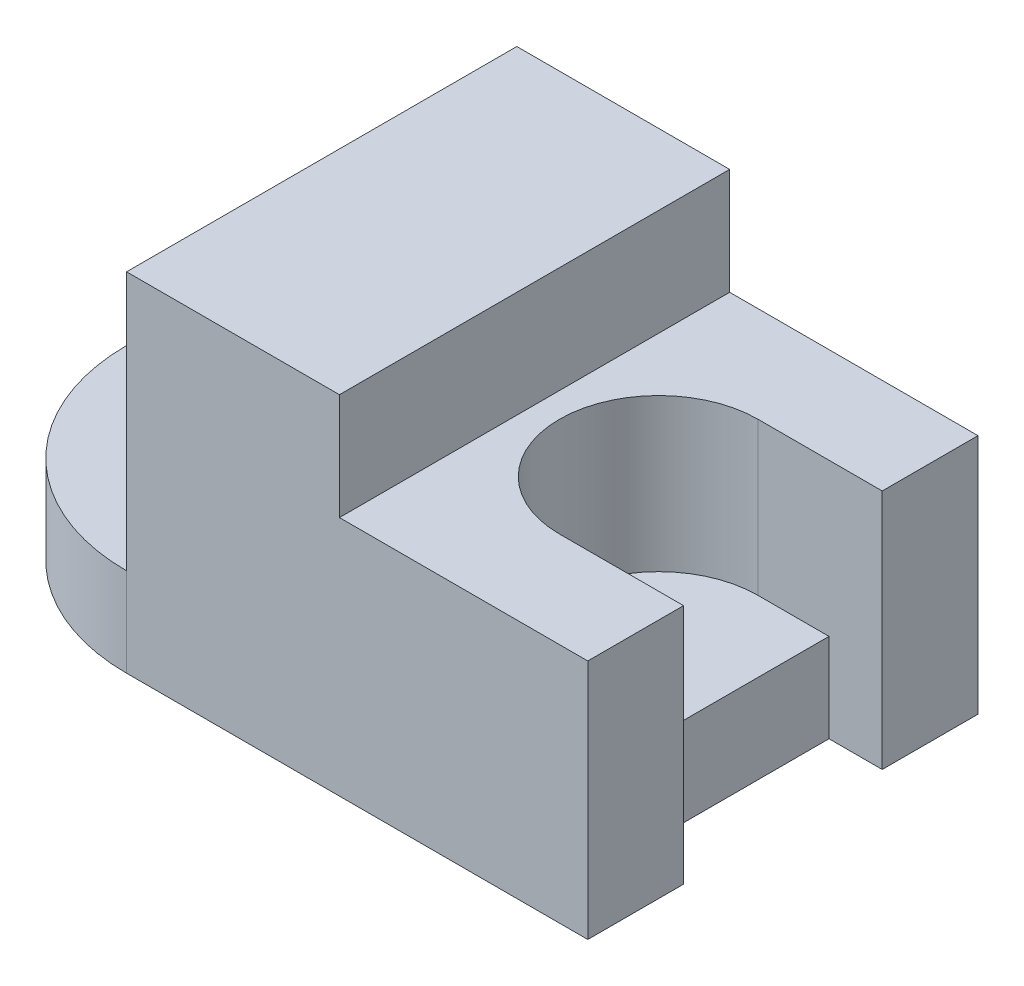
ISO-10303-21;
HEADER;
FILE_DESCRIPTION(('STEP AP214'),'2;1');
FILE_NAME('part.step','',(''),(''),'','','');
FILE_SCHEMA(('AUTOMOTIVE_DESIGN { 1 0 10303 214 1 1 1 1 }'));
ENDSEC;
DATA;
#1=APPLICATION_CONTEXT('core data for automotive mechanical design processes');
#2=APPLICATION_PROTOCOL_DEFINITION('international standard','automotive_design',2000,#1);
#3=PRODUCT_CONTEXT('',#1,'mechanical');
#4=PRODUCT('Part','Part','',(#3));
#5=PRODUCT_RELATED_PRODUCT_CATEGORY('part','',(#4));
#6=PRODUCT_DEFINITION_FORMATION('','',#4);
#7=PRODUCT_DEFINITION_CONTEXT('part definition',#1,'design');
#8=PRODUCT_DEFINITION('design','',#6,#7);
#9=PRODUCT_DEFINITION_SHAPE('','',#8);
#10=(LENGTH_UNIT() NAMED_UNIT(*) SI_UNIT(.MILLI.,.METRE.));
#11=(NAMED_UNIT(*) PLANE_ANGLE_UNIT() SI_UNIT($,.RADIAN.));
#12=(NAMED_UNIT(*) SI_UNIT($,.STERADIAN.) SOLID_ANGLE_UNIT());
#13=UNCERTAINTY_MEASURE_WITH_UNIT(LENGTH_MEASURE(1.E-05),#10,'distance_accuracy_value','');
#14=(GEOMETRIC_REPRESENTATION_CONTEXT(3) GLOBAL_UNCERTAINTY_ASSIGNED_CONTEXT((#13)) GLOBAL_UNIT_ASSIGNED_CONTEXT((#10,
#11,#12)) REPRESENTATION_CONTEXT('',''));
#15=CARTESIAN_POINT('',(0.,0.,0.));
#16=DIRECTION('',(0.,0.,1.));
#17=DIRECTION('',(1.,0.,0.));
#18=AXIS2_PLACEMENT_3D('',#15,#16,#17);
#19=CARTESIAN_POINT('',(130.,25.,-55.));
#20=DIRECTION('',(-1.,0.,0.));
#21=DIRECTION('',(0.,0.,1.));
#22=AXIS2_PLACEMENT_3D('',#19,#20,#21);
#23=PLANE('',#22);
#24=DIRECTION('',(0.,0.,-1.));
#25=VECTOR('',#24,1.);
#26=CARTESIAN_POINT('',(130.,0.,-55.));
#27=LINE('',#26,#25);
#28=CARTESIAN_POINT('',(130.,0.,55.));
#29=VERTEX_POINT('',#28);
#30=CARTESIAN_POINT('',(130.,0.,28.));
#31=VERTEX_POINT('',#30);
#32=EDGE_CURVE('E253',#29,#31,#27,.T.);
#33=ORIENTED_EDGE('',*,*,#32,.T.);
#34=DIRECTION('',(0.,-1.,0.));
#35=VECTOR('',#34,1.);
#36=CARTESIAN_POINT('',(130.,0.,28.));
#37=LINE('',#36,#35);
#38=CARTESIAN_POINT('',(130.,68.,28.));
#39=VERTEX_POINT('',#38);
#40=EDGE_CURVE('E180',#39,#31,#37,.T.);
#41=ORIENTED_EDGE('',*,*,#40,.F.);
#42=DIRECTION('',(0.,0.,-1.));
#43=VECTOR('',#42,1.);
#44=CARTESIAN_POINT('',(130.,68.,-55.));
#45=LINE('',#44,#43);
#46=CARTESIAN_POINT('',(130.,68.,55.));
#47=VERTEX_POINT('',#46);
#48=EDGE_CURVE('E224',#47,#39,#45,.T.);
#49=ORIENTED_EDGE('',*,*,#48,.F.);
#50=DIRECTION('',(0.,-1.,0.));
#51=VECTOR('',#50,1.);
#52=CARTESIAN_POINT('',(130.,25.,55.));
#53=LINE('',#52,#51);
#54=EDGE_CURVE('E261',#47,#29,#53,.T.);
#55=ORIENTED_EDGE('',*,*,#54,.T.);
#56=EDGE_LOOP('',(#33,#41,#49,#55));
#57=FACE_BOUND('',#56,.T.);
#58=ADVANCED_FACE('F41',(#57),#23,.F.);
#59=CARTESIAN_POINT('',(0.,25.,0.));
#60=DIRECTION('',(0.,1.,0.));
#61=DIRECTION('',(0.,0.,1.));
#62=AXIS2_PLACEMENT_3D('',#59,#60,#61);
#63=PLANE('',#62);
#64=DIRECTION('',(0.,0.,1.));
#65=VECTOR('',#64,1.);
#66=CARTESIAN_POINT('',(0.,25.,-55.));
#67=LINE('',#66,#65);
#68=CARTESIAN_POINT('',(-2.93284432462823E-13,25.,42.));
#69=VERTEX_POINT('',#68);
#70=CARTESIAN_POINT('',(0.,25.,55.));
#71=VERTEX_POINT('',#70);
#72=EDGE_CURVE('E11',#69,#71,#67,.T.);
#73=ORIENTED_EDGE('',*,*,#72,.F.);
#74=CARTESIAN_POINT('',(0.,25.,0.));
#75=DIRECTION('',(0.,1.,0.));
#76=DIRECTION('',(0.,0.,1.));
#77=AXIS2_PLACEMENT_3D('',#74,#75,#76);
#78=CIRCLE('',#77,42.);
#79=CARTESIAN_POINT('',(0.,25.,-42.));
#80=VERTEX_POINT('',#79);
#81=EDGE_CURVE('E198',#69,#80,#78,.T.);
#82=ORIENTED_EDGE('',*,*,#81,.T.);
#83=CARTESIAN_POINT('',(0.,25.,-55.));
#84=VERTEX_POINT('',#83);
#85=EDGE_CURVE('E51',#84,#80,#67,.T.);
#86=ORIENTED_EDGE('',*,*,#85,.F.);
#87=CARTESIAN_POINT('',(0.,25.,0.));
#88=DIRECTION('',(0.,1.,0.));
#89=DIRECTION('',(0.,0.,1.));
#90=AXIS2_PLACEMENT_3D('',#87,#88,#89);
#91=CIRCLE('',#90,55.);
#92=EDGE_CURVE('E243',#84,#71,#91,.T.);
#93=ORIENTED_EDGE('',*,*,#92,.T.);
#94=EDGE_LOOP('',(#73,#82,#86,#93));
#95=FACE_BOUND('',#94,.T.);
#96=CARTESIAN_POINT('',(0.,25.,0.));
#97=DIRECTION('',(0.,1.,0.));
#98=DIRECTION('',(0.,0.,1.));
#99=AXIS2_PLACEMENT_3D('',#96,#97,#98);
#100=CIRCLE('',#99,15.);
#101=CARTESIAN_POINT('',(0.,25.,15.));
#102=VERTEX_POINT('',#101);
#103=EDGE_CURVE('E237',#102,#102,#100,.T.);
#104=ORIENTED_EDGE('',*,*,#103,.F.);
#105=EDGE_LOOP('',(#104));
#106=FACE_BOUND('',#105,.T.);
#107=ADVANCED_FACE('F303',(#95,#106),#63,.T.);
#108=CARTESIAN_POINT('',(0.,0.,0.));
#109=DIRECTION('',(0.,1.,0.));
#110=DIRECTION('',(0.,0.,1.));
#111=AXIS2_PLACEMENT_3D('',#108,#109,#110);
#112=PLANE('',#111);
#113=DIRECTION('',(0.,0.,-1.));
#114=VECTOR('',#113,1.);
#115=CARTESIAN_POINT('',(115.,0.,28.));
#116=LINE('',#115,#114);
#117=CARTESIAN_POINT('',(115.,0.,28.));
#118=VERTEX_POINT('',#117);
#119=CARTESIAN_POINT('',(115.,0.,-28.));
#120=VERTEX_POINT('',#119);
#121=EDGE_CURVE('E169',#118,#120,#116,.T.);
#122=ORIENTED_EDGE('',*,*,#121,.F.);
#123=DIRECTION('',(1.,0.,0.));
#124=VECTOR('',#123,1.);
#125=CARTESIAN_POINT('',(115.,0.,28.));
#126=LINE('',#125,#124);
#127=EDGE_CURVE('E171',#118,#31,#126,.T.);
#128=ORIENTED_EDGE('',*,*,#127,.T.);
#129=ORIENTED_EDGE('',*,*,#32,.F.);
#130=DIRECTION('',(1.,0.,0.));
#131=VECTOR('',#130,1.);
#132=CARTESIAN_POINT('',(0.,0.,55.));
#133=LINE('',#132,#131);
#134=CARTESIAN_POINT('',(0.,0.,55.));
#135=VERTEX_POINT('',#134);
#136=EDGE_CURVE('E250',#135,#29,#133,.T.);
#137=ORIENTED_EDGE('',*,*,#136,.F.);
#138=CARTESIAN_POINT('',(0.,0.,0.));
#139=DIRECTION('',(0.,1.,0.));
#140=DIRECTION('',(0.,0.,1.));
#141=AXIS2_PLACEMENT_3D('',#138,#139,#140);
#142=CIRCLE('',#141,55.);
#143=CARTESIAN_POINT('',(0.,0.,-55.));
#144=VERTEX_POINT('',#143);
#145=EDGE_CURVE('E240',#144,#135,#142,.T.);
#146=ORIENTED_EDGE('',*,*,#145,.F.);
#147=DIRECTION('',(-1.,0.,0.));
#148=VECTOR('',#147,1.);
#149=CARTESIAN_POINT('',(0.,0.,-55.));
#150=LINE('',#149,#148);
#151=CARTESIAN_POINT('',(130.,0.,-55.));
#152=VERTEX_POINT('',#151);
#153=EDGE_CURVE('E247',#152,#144,#150,.T.);
#154=ORIENTED_EDGE('',*,*,#153,.F.);
#155=CARTESIAN_POINT('',(130.,0.,-28.));
#156=VERTEX_POINT('',#155);
#157=EDGE_CURVE('E252',#156,#152,#27,.T.);
#158=ORIENTED_EDGE('',*,*,#157,.F.);
#159=DIRECTION('',(1.,0.,0.));
#160=VECTOR('',#159,1.);
#161=CARTESIAN_POINT('',(115.,0.,-28.));
#162=LINE('',#161,#160);
#163=EDGE_CURVE('E174',#120,#156,#162,.T.);
#164=ORIENTED_EDGE('',*,*,#163,.F.);
#165=EDGE_LOOP('',(#122,#128,#129,#137,#146,#154,#158,#164));
#166=FACE_BOUND('',#165,.T.);
#167=CARTESIAN_POINT('',(0.,0.,0.));
#168=DIRECTION('',(0.,1.,0.));
#169=DIRECTION('',(0.,0.,1.));
#170=AXIS2_PLACEMENT_3D('',#167,#168,#169);
#171=CIRCLE('',#170,15.);
#172=CARTESIAN_POINT('',(0.,0.,15.));
#173=VERTEX_POINT('',#172);
#174=EDGE_CURVE('E236',#173,#173,#171,.T.);
#175=ORIENTED_EDGE('',*,*,#174,.T.);
#176=EDGE_LOOP('',(#175));
#177=FACE_BOUND('',#176,.T.);
#178=ADVANCED_FACE('F278',(#166,#177),#112,.F.);
#179=CARTESIAN_POINT('',(0.,25.,0.));
#180=DIRECTION('',(0.,-1.,0.));
#181=DIRECTION('',(0.,0.,-1.));
#182=AXIS2_PLACEMENT_3D('',#179,#180,#181);
#183=CYLINDRICAL_SURFACE('',#182,55.);
#184=ORIENTED_EDGE('',*,*,#145,.T.);
#185=DIRECTION('',(0.,-1.,0.));
#186=VECTOR('',#185,1.);
#187=CARTESIAN_POINT('',(0.,25.,55.));
#188=LINE('',#187,#186);
#189=EDGE_CURVE('E45',#71,#135,#188,.T.);
#190=ORIENTED_EDGE('',*,*,#189,.F.);
#191=ORIENTED_EDGE('',*,*,#92,.F.);
#192=DIRECTION('',(0.,-1.,0.));
#193=VECTOR('',#192,1.);
#194=CARTESIAN_POINT('',(0.,25.,-55.));
#195=LINE('',#194,#193);
#196=EDGE_CURVE('E246',#84,#144,#195,.T.);
#197=ORIENTED_EDGE('',*,*,#196,.T.);
#198=EDGE_LOOP('',(#184,#190,#191,#197));
#199=FACE_BOUND('',#198,.T.);
#200=ADVANCED_FACE('F43',(#199),#183,.T.);
#201=CARTESIAN_POINT('',(0.,25.,55.));
#202=DIRECTION('',(0.,0.,-1.));
#203=DIRECTION('',(-1.,0.,0.));
#204=AXIS2_PLACEMENT_3D('',#201,#202,#203);
#205=PLANE('',#204);
#206=ORIENTED_EDGE('',*,*,#136,.T.);
#207=ORIENTED_EDGE('',*,*,#54,.F.);
#208=DIRECTION('',(1.,0.,0.));
#209=VECTOR('',#208,1.);
#210=CARTESIAN_POINT('',(0.,68.,55.));
#211=LINE('',#210,#209);
#212=CARTESIAN_POINT('',(60.,68.,55.));
#213=VERTEX_POINT('',#212);
#214=EDGE_CURVE('E221',#213,#47,#211,.T.);
#215=ORIENTED_EDGE('',*,*,#214,.F.);
#216=DIRECTION('',(0.,-1.,0.));
#217=VECTOR('',#216,1.);
#218=CARTESIAN_POINT('',(60.,98.,55.));
#219=LINE('',#218,#217);
#220=CARTESIAN_POINT('',(60.,98.,55.));
#221=VERTEX_POINT('',#220);
#222=EDGE_CURVE('E218',#221,#213,#219,.T.);
#223=ORIENTED_EDGE('',*,*,#222,.F.);
#224=DIRECTION('',(1.,0.,0.));
#225=VECTOR('',#224,1.);
#226=CARTESIAN_POINT('',(0.,98.,55.));
#227=LINE('',#226,#225);
#228=CARTESIAN_POINT('',(0.,98.,55.));
#229=VERTEX_POINT('',#228);
#230=EDGE_CURVE('E206',#229,#221,#227,.T.);
#231=ORIENTED_EDGE('',*,*,#230,.F.);
#232=DIRECTION('',(0.,-1.,0.));
#233=VECTOR('',#232,1.);
#234=CARTESIAN_POINT('',(0.,68.,55.));
#235=LINE('',#234,#233);
#236=EDGE_CURVE('E233',#229,#71,#235,.T.);
#237=ORIENTED_EDGE('',*,*,#236,.T.);
#238=ORIENTED_EDGE('',*,*,#189,.T.);
#239=EDGE_LOOP('',(#206,#207,#215,#223,#231,#237,#238));
#240=FACE_BOUND('',#239,.T.);
#241=ADVANCED_FACE('F270',(#240),#205,.F.);
#242=CARTESIAN_POINT('',(130.,68.,-28.));
#243=VERTEX_POINT('',#242);
#244=CARTESIAN_POINT('',(130.,68.,-55.));
#245=VERTEX_POINT('',#244);
#246=EDGE_CURVE('E223',#243,#245,#45,.T.);
#247=ORIENTED_EDGE('',*,*,#246,.F.);
#248=DIRECTION('',(0.,1.,0.));
#249=VECTOR('',#248,1.);
#250=CARTESIAN_POINT('',(130.,0.,-28.));
#251=LINE('',#250,#249);
#252=EDGE_CURVE('E182',#156,#243,#251,.T.);
#253=ORIENTED_EDGE('',*,*,#252,.F.);
#254=ORIENTED_EDGE('',*,*,#157,.T.);
#255=DIRECTION('',(0.,-1.,0.));
#256=VECTOR('',#255,1.);
#257=CARTESIAN_POINT('',(130.,25.,-55.));
#258=LINE('',#257,#256);
#259=EDGE_CURVE('E259',#245,#152,#258,.T.);
#260=ORIENTED_EDGE('',*,*,#259,.F.);
#261=EDGE_LOOP('',(#247,#253,#254,#260));
#262=FACE_BOUND('',#261,.T.);
#263=ADVANCED_FACE('F311',(#262),#23,.F.);
#264=CARTESIAN_POINT('',(0.,25.,-55.));
#265=DIRECTION('',(0.,0.,1.));
#266=DIRECTION('',(1.,0.,0.));
#267=AXIS2_PLACEMENT_3D('',#264,#265,#266);
#268=PLANE('',#267);
#269=ORIENTED_EDGE('',*,*,#153,.T.);
#270=ORIENTED_EDGE('',*,*,#196,.F.);
#271=DIRECTION('',(0.,-1.,0.));
#272=VECTOR('',#271,1.);
#273=CARTESIAN_POINT('',(0.,68.,-55.));
#274=LINE('',#273,#272);
#275=CARTESIAN_POINT('',(0.,98.,-55.));
#276=VERTEX_POINT('',#275);
#277=EDGE_CURVE('E228',#276,#84,#274,.T.);
#278=ORIENTED_EDGE('',*,*,#277,.F.);
#279=DIRECTION('',(-1.,0.,0.));
#280=VECTOR('',#279,1.);
#281=CARTESIAN_POINT('',(0.,98.,-55.));
#282=LINE('',#281,#280);
#283=CARTESIAN_POINT('',(60.,98.,-55.));
#284=VERTEX_POINT('',#283);
#285=EDGE_CURVE('E210',#284,#276,#282,.T.);
#286=ORIENTED_EDGE('',*,*,#285,.F.);
#287=DIRECTION('',(0.,-1.,0.));
#288=VECTOR('',#287,1.);
#289=CARTESIAN_POINT('',(60.,98.,-55.));
#290=LINE('',#289,#288);
#291=CARTESIAN_POINT('',(60.,68.,-55.));
#292=VERTEX_POINT('',#291);
#293=EDGE_CURVE('E213',#284,#292,#290,.T.);
#294=ORIENTED_EDGE('',*,*,#293,.T.);
#295=DIRECTION('',(-1.,0.,0.));
#296=VECTOR('',#295,1.);
#297=CARTESIAN_POINT('',(0.,68.,-55.));
#298=LINE('',#297,#296);
#299=EDGE_CURVE('E227',#245,#292,#298,.T.);
#300=ORIENTED_EDGE('',*,*,#299,.F.);
#301=ORIENTED_EDGE('',*,*,#259,.T.);
#302=EDGE_LOOP('',(#269,#270,#278,#286,#294,#300,#301));
#303=FACE_BOUND('',#302,.T.);
#304=ADVANCED_FACE('F306',(#303),#268,.F.);
#305=CARTESIAN_POINT('',(0.,25.,0.));
#306=DIRECTION('',(0.,-1.,0.));
#307=DIRECTION('',(0.,0.,-1.));
#308=AXIS2_PLACEMENT_3D('',#305,#306,#307);
#309=CYLINDRICAL_SURFACE('',#308,15.);
#310=ORIENTED_EDGE('',*,*,#103,.T.);
#311=EDGE_LOOP('',(#310));
#312=FACE_BOUND('',#311,.T.);
#313=ORIENTED_EDGE('',*,*,#174,.F.);
#314=EDGE_LOOP('',(#313));
#315=FACE_BOUND('',#314,.T.);
#316=ADVANCED_FACE('F344',(#312,#315),#309,.F.);
#317=CARTESIAN_POINT('',(0.,68.,-55.));
#318=DIRECTION('',(1.,0.,0.));
#319=DIRECTION('',(0.,0.,-1.));
#320=AXIS2_PLACEMENT_3D('',#317,#318,#319);
#321=PLANE('',#320);
#322=ORIENTED_EDGE('',*,*,#85,.T.);
#323=DIRECTION('',(0.,-1.,0.));
#324=VECTOR('',#323,1.);
#325=CARTESIAN_POINT('',(0.,25.,-42.));
#326=LINE('',#325,#324);
#327=CARTESIAN_POINT('',(0.,53.,-42.));
#328=VERTEX_POINT('',#327);
#329=EDGE_CURVE('E66',#328,#80,#326,.T.);
#330=ORIENTED_EDGE('',*,*,#329,.F.);
#331=DIRECTION('',(0.,0.,1.));
#332=VECTOR('',#331,1.);
#333=CARTESIAN_POINT('',(0.,53.,0.));
#334=LINE('',#333,#332);
#335=CARTESIAN_POINT('',(-2.93284432462823E-13,53.,42.));
#336=VERTEX_POINT('',#335);
#337=EDGE_CURVE('E192',#328,#336,#334,.T.);
#338=ORIENTED_EDGE('',*,*,#337,.T.);
#339=DIRECTION('',(0.,-1.,0.));
#340=VECTOR('',#339,1.);
#341=CARTESIAN_POINT('',(-2.93284432462823E-13,25.,42.));
#342=LINE('',#341,#340);
#343=EDGE_CURVE('E195',#336,#69,#342,.T.);
#344=ORIENTED_EDGE('',*,*,#343,.T.);
#345=ORIENTED_EDGE('',*,*,#72,.T.);
#346=ORIENTED_EDGE('',*,*,#236,.F.);
#347=DIRECTION('',(0.,0.,1.));
#348=VECTOR('',#347,1.);
#349=CARTESIAN_POINT('',(0.,98.,-55.));
#350=LINE('',#349,#348);
#351=EDGE_CURVE('E203',#276,#229,#350,.T.);
#352=ORIENTED_EDGE('',*,*,#351,.F.);
#353=ORIENTED_EDGE('',*,*,#277,.T.);
#354=EDGE_LOOP('',(#322,#330,#338,#344,#345,#346,#352,#353));
#355=FACE_BOUND('',#354,.T.);
#356=ADVANCED_FACE('F299',(#355),#321,.F.);
#357=CARTESIAN_POINT('',(0.,68.,0.));
#358=DIRECTION('',(0.,1.,0.));
#359=DIRECTION('',(0.,0.,1.));
#360=AXIS2_PLACEMENT_3D('',#357,#358,#359);
#361=PLANE('',#360);
#362=DIRECTION('',(1.,0.,0.));
#363=VECTOR('',#362,1.);
#364=CARTESIAN_POINT('',(115.,68.,28.));
#365=LINE('',#364,#363);
#366=CARTESIAN_POINT('',(95.,68.,28.));
#367=VERTEX_POINT('',#366);
#368=EDGE_CURVE('E185',#367,#39,#365,.T.);
#369=ORIENTED_EDGE('',*,*,#368,.F.);
#370=CARTESIAN_POINT('',(95.,68.,0.));
#371=DIRECTION('',(0.,1.,0.));
#372=DIRECTION('',(0.,0.,-1.));
#373=AXIS2_PLACEMENT_3D('',#370,#371,#372);
#374=CIRCLE('',#373,28.);
#375=CARTESIAN_POINT('',(95.,68.,-28.));
#376=VERTEX_POINT('',#375);
#377=EDGE_CURVE('E165',#376,#367,#374,.T.);
#378=ORIENTED_EDGE('',*,*,#377,.F.);
#379=DIRECTION('',(1.,0.,0.));
#380=VECTOR('',#379,1.);
#381=CARTESIAN_POINT('',(115.,68.,-28.));
#382=LINE('',#381,#380);
#383=EDGE_CURVE('E187',#376,#243,#382,.T.);
#384=ORIENTED_EDGE('',*,*,#383,.T.);
#385=ORIENTED_EDGE('',*,*,#246,.T.);
#386=ORIENTED_EDGE('',*,*,#299,.T.);
#387=DIRECTION('',(0.,0.,-1.));
#388=VECTOR('',#387,1.);
#389=CARTESIAN_POINT('',(60.,68.,-55.));
#390=LINE('',#389,#388);
#391=EDGE_CURVE('E202',#213,#292,#390,.T.);
#392=ORIENTED_EDGE('',*,*,#391,.F.);
#393=ORIENTED_EDGE('',*,*,#214,.T.);
#394=ORIENTED_EDGE('',*,*,#48,.T.);
#395=EDGE_LOOP('',(#369,#378,#384,#385,#386,#392,#393,#394));
#396=FACE_BOUND('',#395,.T.);
#397=ADVANCED_FACE('F285',(#396),#361,.T.);
#398=CARTESIAN_POINT('',(60.,98.,-55.));
#399=DIRECTION('',(-1.,0.,0.));
#400=DIRECTION('',(0.,0.,1.));
#401=AXIS2_PLACEMENT_3D('',#398,#399,#400);
#402=PLANE('',#401);
#403=ORIENTED_EDGE('',*,*,#391,.T.);
#404=ORIENTED_EDGE('',*,*,#293,.F.);
#405=DIRECTION('',(0.,0.,-1.));
#406=VECTOR('',#405,1.);
#407=CARTESIAN_POINT('',(60.,98.,-55.));
#408=LINE('',#407,#406);
#409=EDGE_CURVE('E208',#221,#284,#408,.T.);
#410=ORIENTED_EDGE('',*,*,#409,.F.);
#411=ORIENTED_EDGE('',*,*,#222,.T.);
#412=EDGE_LOOP('',(#403,#404,#410,#411));
#413=FACE_BOUND('',#412,.T.);
#414=ADVANCED_FACE('F292',(#413),#402,.F.);
#415=CARTESIAN_POINT('',(0.,98.,0.));
#416=DIRECTION('',(0.,1.,0.));
#417=DIRECTION('',(0.,0.,1.));
#418=AXIS2_PLACEMENT_3D('',#415,#416,#417);
#419=PLANE('',#418);
#420=ORIENTED_EDGE('',*,*,#351,.T.);
#421=ORIENTED_EDGE('',*,*,#230,.T.);
#422=ORIENTED_EDGE('',*,*,#409,.T.);
#423=ORIENTED_EDGE('',*,*,#285,.T.);
#424=EDGE_LOOP('',(#420,#421,#422,#423));
#425=FACE_BOUND('',#424,.T.);
#426=ADVANCED_FACE('F296',(#425),#419,.T.);
#427=CARTESIAN_POINT('',(0.,53.,0.));
#428=DIRECTION('',(0.,1.,0.));
#429=DIRECTION('',(0.,0.,1.));
#430=AXIS2_PLACEMENT_3D('',#427,#428,#429);
#431=PLANE('',#430);
#432=CARTESIAN_POINT('',(0.,53.,0.));
#433=DIRECTION('',(0.,1.,0.));
#434=DIRECTION('',(0.,0.,1.));
#435=AXIS2_PLACEMENT_3D('',#432,#433,#434);
#436=CIRCLE('',#435,42.);
#437=EDGE_CURVE('E200',#336,#328,#436,.T.);
#438=ORIENTED_EDGE('',*,*,#437,.F.);
#439=ORIENTED_EDGE('',*,*,#337,.F.);
#440=EDGE_LOOP('',(#438,#439));
#441=FACE_BOUND('',#440,.T.);
#442=ADVANCED_FACE('F330',(#441),#431,.F.);
#443=CARTESIAN_POINT('',(0.,0.,0.));
#444=DIRECTION('',(0.,1.,0.));
#445=DIRECTION('',(0.,0.,1.));
#446=AXIS2_PLACEMENT_3D('',#443,#444,#445);
#447=CYLINDRICAL_SURFACE('',#446,42.);
#448=ORIENTED_EDGE('',*,*,#81,.F.);
#449=ORIENTED_EDGE('',*,*,#343,.F.);
#450=ORIENTED_EDGE('',*,*,#437,.T.);
#451=ORIENTED_EDGE('',*,*,#329,.T.);
#452=EDGE_LOOP('',(#448,#449,#450,#451));
#453=FACE_BOUND('',#452,.T.);
#454=ADVANCED_FACE('F322',(#453),#447,.F.);
#455=CARTESIAN_POINT('',(115.,0.,28.));
#456=DIRECTION('',(0.,0.,1.));
#457=DIRECTION('',(1.,0.,0.));
#458=AXIS2_PLACEMENT_3D('',#455,#456,#457);
#459=PLANE('',#458);
#460=ORIENTED_EDGE('',*,*,#40,.T.);
#461=ORIENTED_EDGE('',*,*,#127,.F.);
#462=DIRECTION('',(0.,-1.,0.));
#463=VECTOR('',#462,1.);
#464=CARTESIAN_POINT('',(115.,0.,28.));
#465=LINE('',#464,#463);
#466=CARTESIAN_POINT('',(115.,25.,28.));
#467=VERTEX_POINT('',#466);
#468=EDGE_CURVE('E176',#467,#118,#465,.T.);
#469=ORIENTED_EDGE('',*,*,#468,.F.);
#470=DIRECTION('',(1.,0.,0.));
#471=VECTOR('',#470,1.);
#472=CARTESIAN_POINT('',(115.,25.,28.));
#473=LINE('',#472,#471);
#474=CARTESIAN_POINT('',(95.,25.,28.));
#475=VERTEX_POINT('',#474);
#476=EDGE_CURVE('E58',#475,#467,#473,.T.);
#477=ORIENTED_EDGE('',*,*,#476,.F.);
#478=DIRECTION('',(0.,1.,0.));
#479=VECTOR('',#478,1.);
#480=CARTESIAN_POINT('',(95.,25.,28.));
#481=LINE('',#480,#479);
#482=EDGE_CURVE('E183',#475,#367,#481,.T.);
#483=ORIENTED_EDGE('',*,*,#482,.T.);
#484=ORIENTED_EDGE('',*,*,#368,.T.);
#485=EDGE_LOOP('',(#460,#461,#469,#477,#483,#484));
#486=FACE_BOUND('',#485,.T.);
#487=ADVANCED_FACE('F320',(#486),#459,.F.);
#488=CARTESIAN_POINT('',(115.,0.,-28.));
#489=DIRECTION('',(0.,0.,-1.));
#490=DIRECTION('',(-1.,0.,0.));
#491=AXIS2_PLACEMENT_3D('',#488,#489,#490);
#492=PLANE('',#491);
#493=ORIENTED_EDGE('',*,*,#252,.T.);
#494=ORIENTED_EDGE('',*,*,#383,.F.);
#495=DIRECTION('',(0.,1.,0.));
#496=VECTOR('',#495,1.);
#497=CARTESIAN_POINT('',(95.,25.,-28.));
#498=LINE('',#497,#496);
#499=CARTESIAN_POINT('',(95.,25.,-28.));
#500=VERTEX_POINT('',#499);
#501=EDGE_CURVE('E157',#500,#376,#498,.T.);
#502=ORIENTED_EDGE('',*,*,#501,.F.);
#503=DIRECTION('',(-1.,0.,0.));
#504=VECTOR('',#503,1.);
#505=CARTESIAN_POINT('',(115.,25.,-28.));
#506=LINE('',#505,#504);
#507=CARTESIAN_POINT('',(115.,25.,-28.));
#508=VERTEX_POINT('',#507);
#509=EDGE_CURVE('E151',#508,#500,#506,.T.);
#510=ORIENTED_EDGE('',*,*,#509,.F.);
#511=DIRECTION('',(0.,1.,0.));
#512=VECTOR('',#511,1.);
#513=CARTESIAN_POINT('',(115.,0.,-28.));
#514=LINE('',#513,#512);
#515=EDGE_CURVE('E154',#120,#508,#514,.T.);
#516=ORIENTED_EDGE('',*,*,#515,.F.);
#517=ORIENTED_EDGE('',*,*,#163,.T.);
#518=EDGE_LOOP('',(#493,#494,#502,#510,#516,#517));
#519=FACE_BOUND('',#518,.T.);
#520=ADVANCED_FACE('F152',(#519),#492,.F.);
#521=CARTESIAN_POINT('',(115.,0.,0.));
#522=DIRECTION('',(-1.,0.,0.));
#523=DIRECTION('',(0.,0.,1.));
#524=AXIS2_PLACEMENT_3D('',#521,#522,#523);
#525=PLANE('',#524);
#526=ORIENTED_EDGE('',*,*,#515,.T.);
#527=DIRECTION('',(0.,0.,-1.));
#528=VECTOR('',#527,1.);
#529=CARTESIAN_POINT('',(115.,25.,-28.));
#530=LINE('',#529,#528);
#531=EDGE_CURVE('E160',#467,#508,#530,.T.);
#532=ORIENTED_EDGE('',*,*,#531,.F.);
#533=ORIENTED_EDGE('',*,*,#468,.T.);
#534=ORIENTED_EDGE('',*,*,#121,.T.);
#535=EDGE_LOOP('',(#526,#532,#533,#534));
#536=FACE_BOUND('',#535,.T.);
#537=ADVANCED_FACE('F167',(#536),#525,.F.);
#538=CARTESIAN_POINT('',(95.,25.,0.));
#539=DIRECTION('',(0.,1.,0.));
#540=DIRECTION('',(0.,0.,1.));
#541=AXIS2_PLACEMENT_3D('',#538,#539,#540);
#542=CYLINDRICAL_SURFACE('',#541,28.);
#543=ORIENTED_EDGE('',*,*,#377,.T.);
#544=ORIENTED_EDGE('',*,*,#482,.F.);
#545=CARTESIAN_POINT('',(95.,25.,0.));
#546=DIRECTION('',(0.,1.,0.));
#547=DIRECTION('',(0.,0.,-1.));
#548=AXIS2_PLACEMENT_3D('',#545,#546,#547);
#549=CIRCLE('',#548,28.);
#550=EDGE_CURVE('E159',#500,#475,#549,.T.);
#551=ORIENTED_EDGE('',*,*,#550,.F.);
#552=ORIENTED_EDGE('',*,*,#501,.T.);
#553=EDGE_LOOP('',(#543,#544,#551,#552));
#554=FACE_BOUND('',#553,.T.);
#555=ADVANCED_FACE('F409',(#554),#542,.F.);
#556=CARTESIAN_POINT('',(95.,25.,0.));
#557=DIRECTION('',(0.,-1.,0.));
#558=DIRECTION('',(0.,0.,-1.));
#559=AXIS2_PLACEMENT_3D('',#556,#557,#558);
#560=PLANE('',#559);
#561=ORIENTED_EDGE('',*,*,#531,.T.);
#562=ORIENTED_EDGE('',*,*,#509,.T.);
#563=ORIENTED_EDGE('',*,*,#550,.T.);
#564=ORIENTED_EDGE('',*,*,#476,.T.);
#565=EDGE_LOOP('',(#561,#562,#563,#564));
#566=FACE_BOUND('',#565,.T.);
#567=ADVANCED_FACE('F162',(#566),#560,.F.);
#568=CLOSED_SHELL('',(#58,#107,#178,#200,#241,#263,#304,#316,#356,#397,#414,#426,#442,#454,#487,
#520,#537,#555,#567));
#569=MANIFOLD_SOLID_BREP('B2',#568);
#570=ADVANCED_BREP_SHAPE_REPRESENTATION('',(#18,#569),#14);
#571=SHAPE_DEFINITION_REPRESENTATION(#9,#570);
ENDSEC;
END-ISO-10303-21;
